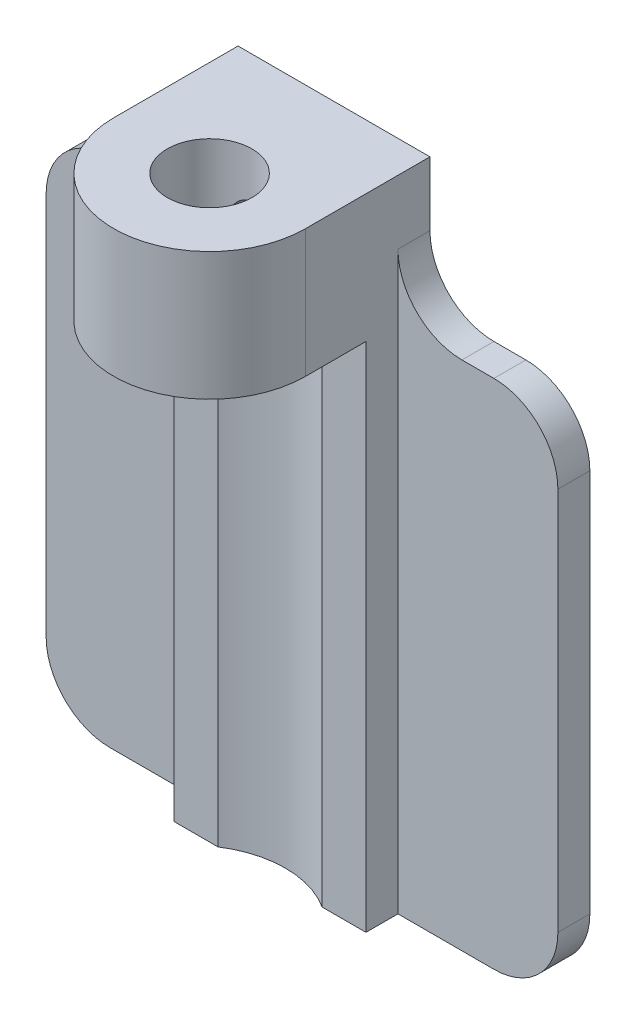
ISO-10303-21;
HEADER;
FILE_DESCRIPTION(('STEP AP214'),'2;1');
FILE_NAME('part.step','',(''),(''),'','','');
FILE_SCHEMA(('AUTOMOTIVE_DESIGN { 1 0 10303 214 1 1 1 1 }'));
ENDSEC;
DATA;
#1=APPLICATION_CONTEXT('core data for automotive mechanical design processes');
#2=APPLICATION_PROTOCOL_DEFINITION('international standard','automotive_design',2000,#1);
#3=PRODUCT_CONTEXT('',#1,'mechanical');
#4=PRODUCT('Part','Part','',(#3));
#5=PRODUCT_RELATED_PRODUCT_CATEGORY('part','',(#4));
#6=PRODUCT_DEFINITION_FORMATION('','',#4);
#7=PRODUCT_DEFINITION_CONTEXT('part definition',#1,'design');
#8=PRODUCT_DEFINITION('design','',#6,#7);
#9=PRODUCT_DEFINITION_SHAPE('','',#8);
#10=(LENGTH_UNIT() NAMED_UNIT(*) SI_UNIT(.MILLI.,.METRE.));
#11=(NAMED_UNIT(*) PLANE_ANGLE_UNIT() SI_UNIT($,.RADIAN.));
#12=(NAMED_UNIT(*) SI_UNIT($,.STERADIAN.) SOLID_ANGLE_UNIT());
#13=UNCERTAINTY_MEASURE_WITH_UNIT(LENGTH_MEASURE(1.E-05),#10,'distance_accuracy_value','');
#14=(GEOMETRIC_REPRESENTATION_CONTEXT(3) GLOBAL_UNCERTAINTY_ASSIGNED_CONTEXT((#13)) GLOBAL_UNIT_ASSIGNED_CONTEXT((#10,
#11,#12)) REPRESENTATION_CONTEXT('',''));
#15=CARTESIAN_POINT('',(0.,0.,0.));
#16=DIRECTION('',(0.,0.,1.));
#17=DIRECTION('',(1.,0.,0.));
#18=AXIS2_PLACEMENT_3D('',#15,#16,#17);
#19=CARTESIAN_POINT('',(4.7625,12.7,4.7625));
#20=DIRECTION('',(0.,1.,0.));
#21=DIRECTION('',(0.,0.,1.));
#22=AXIS2_PLACEMENT_3D('',#19,#20,#21);
#23=PLANE('',#22);
#24=CARTESIAN_POINT('',(0.,12.7,0.));
#25=DIRECTION('',(0.,1.,0.));
#26=DIRECTION('',(0.,0.,1.));
#27=AXIS2_PLACEMENT_3D('',#24,#25,#26);
#28=CIRCLE('',#27,2.1);
#29=CARTESIAN_POINT('',(0.,12.7,2.10000000000001));
#30=VERTEX_POINT('',#29);
#31=EDGE_CURVE('E276',#30,#30,#28,.T.);
#32=ORIENTED_EDGE('',*,*,#31,.T.);
#33=EDGE_LOOP('',(#32));
#34=FACE_BOUND('',#33,.T.);
#35=CARTESIAN_POINT('',(0.,12.7,0.));
#36=DIRECTION('',(0.,1.,0.));
#37=DIRECTION('',(0.,0.,1.));
#38=AXIS2_PLACEMENT_3D('',#35,#36,#37);
#39=CIRCLE('',#38,4.76249999999999);
#40=CARTESIAN_POINT('',(4.7625,12.7,0.));
#41=VERTEX_POINT('',#40);
#42=CARTESIAN_POINT('',(-4.7625,12.7,0.));
#43=VERTEX_POINT('',#42);
#44=EDGE_CURVE('E231',#41,#43,#39,.F.);
#45=ORIENTED_EDGE('',*,*,#44,.T.);
#46=DIRECTION('',(0.,0.,-1.));
#47=VECTOR('',#46,1.);
#48=CARTESIAN_POINT('',(-4.7625,12.7,4.7625));
#49=LINE('',#48,#47);
#50=CARTESIAN_POINT('',(-4.7625,12.7,-3.));
#51=VERTEX_POINT('',#50);
#52=EDGE_CURVE('E279',#43,#51,#49,.T.);
#53=ORIENTED_EDGE('',*,*,#52,.T.);
#54=DIRECTION('',(-1.,0.,0.));
#55=VECTOR('',#54,1.);
#56=CARTESIAN_POINT('',(4.7625,12.7,-3.));
#57=LINE('',#56,#55);
#58=CARTESIAN_POINT('',(-2.58406772357073,12.7,-2.99999999999999));
#59=VERTEX_POINT('',#58);
#60=EDGE_CURVE('E298',#59,#51,#57,.T.);
#61=ORIENTED_EDGE('',*,*,#60,.F.);
#62=CARTESIAN_POINT('',(0.,12.7,1.0005));
#63=DIRECTION('',(0.,1.,0.));
#64=DIRECTION('',(0.,0.,1.));
#65=AXIS2_PLACEMENT_3D('',#62,#63,#64);
#66=CIRCLE('',#65,4.7625);
#67=CARTESIAN_POINT('',(2.58406772357073,12.7,-2.99999999999999));
#68=VERTEX_POINT('',#67);
#69=EDGE_CURVE('E264',#59,#68,#66,.F.);
#70=ORIENTED_EDGE('',*,*,#69,.T.);
#71=CARTESIAN_POINT('',(4.7625,12.7,-3.));
#72=VERTEX_POINT('',#71);
#73=EDGE_CURVE('E299',#72,#68,#57,.T.);
#74=ORIENTED_EDGE('',*,*,#73,.F.);
#75=DIRECTION('',(0.,0.,-1.));
#76=VECTOR('',#75,1.);
#77=CARTESIAN_POINT('',(4.7625,12.7,4.7625));
#78=LINE('',#77,#76);
#79=EDGE_CURVE('E280',#41,#72,#78,.T.);
#80=ORIENTED_EDGE('',*,*,#79,.F.);
#81=EDGE_LOOP('',(#45,#53,#61,#70,#74,#80));
#82=FACE_BOUND('',#81,.T.);
#83=ADVANCED_FACE('F54',(#34,#82),#23,.F.);
#84=CARTESIAN_POINT('',(4.7625,0.,0.));
#85=DIRECTION('',(1.,0.,0.));
#86=DIRECTION('',(0.,0.,-1.));
#87=AXIS2_PLACEMENT_3D('',#84,#85,#86);
#88=PLANE('',#87);
#89=DIRECTION('',(0.,1.,0.));
#90=VECTOR('',#89,1.);
#91=CARTESIAN_POINT('',(4.7625,0.,-4.5875));
#92=LINE('',#91,#90);
#93=CARTESIAN_POINT('',(4.7625,-12.7,-4.5875));
#94=VERTEX_POINT('',#93);
#95=CARTESIAN_POINT('',(4.7625,15.875,-4.5875));
#96=VERTEX_POINT('',#95);
#97=EDGE_CURVE('E69',#94,#96,#92,.T.);
#98=ORIENTED_EDGE('',*,*,#97,.T.);
#99=DIRECTION('',(0.,0.,1.));
#100=VECTOR('',#99,1.);
#101=CARTESIAN_POINT('',(4.7625,15.875,-6.175));
#102=LINE('',#101,#100);
#103=CARTESIAN_POINT('',(4.7625,15.875,-6.175));
#104=VERTEX_POINT('',#103);
#105=EDGE_CURVE('E198',#96,#104,#102,.F.);
#106=ORIENTED_EDGE('',*,*,#105,.T.);
#107=DIRECTION('',(0.,1.,0.));
#108=VECTOR('',#107,1.);
#109=CARTESIAN_POINT('',(4.7625,-12.7,-6.175));
#110=LINE('',#109,#108);
#111=CARTESIAN_POINT('',(4.7625,19.05,-6.175));
#112=VERTEX_POINT('',#111);
#113=EDGE_CURVE('E192',#104,#112,#110,.T.);
#114=ORIENTED_EDGE('',*,*,#113,.T.);
#115=DIRECTION('',(0.,0.,1.));
#116=VECTOR('',#115,1.);
#117=CARTESIAN_POINT('',(4.7625,19.05,-6.175));
#118=LINE('',#117,#116);
#119=CARTESIAN_POINT('',(4.76249999999999,19.05,0.));
#120=VERTEX_POINT('',#119);
#121=EDGE_CURVE('E196',#112,#120,#118,.T.);
#122=ORIENTED_EDGE('',*,*,#121,.T.);
#123=DIRECTION('',(0.,1.,0.));
#124=VECTOR('',#123,1.);
#125=CARTESIAN_POINT('',(4.7625,-12.7,0.));
#126=LINE('',#125,#124);
#127=EDGE_CURVE('E229',#41,#120,#126,.T.);
#128=ORIENTED_EDGE('',*,*,#127,.F.);
#129=ORIENTED_EDGE('',*,*,#79,.T.);
#130=DIRECTION('',(0.,-1.,0.));
#131=VECTOR('',#130,1.);
#132=CARTESIAN_POINT('',(4.7625,12.7,-3.));
#133=LINE('',#132,#131);
#134=CARTESIAN_POINT('',(4.7625,-12.7,-3.));
#135=VERTEX_POINT('',#134);
#136=EDGE_CURVE('E282',#72,#135,#133,.T.);
#137=ORIENTED_EDGE('',*,*,#136,.T.);
#138=DIRECTION('',(0.,0.,-1.));
#139=VECTOR('',#138,1.);
#140=CARTESIAN_POINT('',(4.7625,-12.7,-3.));
#141=LINE('',#140,#139);
#142=EDGE_CURVE('E203',#135,#94,#141,.T.);
#143=ORIENTED_EDGE('',*,*,#142,.T.);
#144=EDGE_LOOP('',(#98,#106,#114,#122,#128,#129,#137,#143));
#145=FACE_BOUND('',#144,.T.);
#146=ADVANCED_FACE('F194',(#145),#88,.T.);
#147=CARTESIAN_POINT('',(4.7625,-12.7,-6.175));
#148=DIRECTION('',(0.,0.,1.));
#149=DIRECTION('',(1.,0.,0.));
#150=AXIS2_PLACEMENT_3D('',#147,#148,#149);
#151=PLANE('',#150);
#152=CARTESIAN_POINT('',(0.,15.875,-6.175));
#153=DIRECTION('',(0.,0.,-1.));
#154=DIRECTION('',(-1.,0.,0.));
#155=AXIS2_PLACEMENT_3D('',#152,#153,#154);
#156=CIRCLE('',#155,0.888999999999999);
#157=CARTESIAN_POINT('',(-0.888999999999999,15.875,-6.175));
#158=VERTEX_POINT('',#157);
#159=EDGE_CURVE('E223',#158,#158,#156,.T.);
#160=ORIENTED_EDGE('',*,*,#159,.F.);
#161=EDGE_LOOP('',(#160));
#162=FACE_BOUND('',#161,.T.);
#163=DIRECTION('',(-1.,0.,0.));
#164=VECTOR('',#163,1.);
#165=CARTESIAN_POINT('',(4.7625,-12.7,-6.175));
#166=LINE('',#165,#164);
#167=CARTESIAN_POINT('',(9.525,-12.7,-6.175));
#168=VERTEX_POINT('',#167);
#169=CARTESIAN_POINT('',(-9.525,-12.7,-6.175));
#170=VERTEX_POINT('',#169);
#171=EDGE_CURVE('E202',#168,#170,#166,.T.);
#172=ORIENTED_EDGE('',*,*,#171,.T.);
#173=CARTESIAN_POINT('',(-9.525,-9.525,-6.175));
#174=DIRECTION('',(0.,0.,1.));
#175=DIRECTION('',(1.,0.,0.));
#176=AXIS2_PLACEMENT_3D('',#173,#174,#175);
#177=CIRCLE('',#176,3.175);
#178=CARTESIAN_POINT('',(-12.7,-9.525,-6.175));
#179=VERTEX_POINT('',#178);
#180=EDGE_CURVE('E317',#170,#179,#177,.F.);
#181=ORIENTED_EDGE('',*,*,#180,.T.);
#182=DIRECTION('',(0.,1.,0.));
#183=VECTOR('',#182,1.);
#184=CARTESIAN_POINT('',(-12.7,12.7,-6.175));
#185=LINE('',#184,#183);
#186=CARTESIAN_POINT('',(-12.7,9.525,-6.175));
#187=VERTEX_POINT('',#186);
#188=EDGE_CURVE('E243',#179,#187,#185,.T.);
#189=ORIENTED_EDGE('',*,*,#188,.T.);
#190=CARTESIAN_POINT('',(-9.525,9.525,-6.175));
#191=DIRECTION('',(0.,0.,1.));
#192=DIRECTION('',(1.,0.,0.));
#193=AXIS2_PLACEMENT_3D('',#190,#191,#192);
#194=CIRCLE('',#193,3.175);
#195=CARTESIAN_POINT('',(-9.525,12.7,-6.175));
#196=VERTEX_POINT('',#195);
#197=EDGE_CURVE('E315',#187,#196,#194,.F.);
#198=ORIENTED_EDGE('',*,*,#197,.T.);
#199=DIRECTION('',(1.,0.,0.));
#200=VECTOR('',#199,1.);
#201=CARTESIAN_POINT('',(-2.58406772357073,12.7,-6.175));
#202=LINE('',#201,#200);
#203=CARTESIAN_POINT('',(-7.9375,12.7,-6.175));
#204=VERTEX_POINT('',#203);
#205=EDGE_CURVE('E252',#196,#204,#202,.T.);
#206=ORIENTED_EDGE('',*,*,#205,.T.);
#207=CARTESIAN_POINT('',(-7.9375,15.875,-6.175));
#208=DIRECTION('',(0.,0.,1.));
#209=DIRECTION('',(1.,0.,0.));
#210=AXIS2_PLACEMENT_3D('',#207,#208,#209);
#211=CIRCLE('',#210,3.175);
#212=CARTESIAN_POINT('',(-4.7625,15.875,-6.175));
#213=VERTEX_POINT('',#212);
#214=EDGE_CURVE('E352',#204,#213,#211,.T.);
#215=ORIENTED_EDGE('',*,*,#214,.T.);
#216=DIRECTION('',(0.,1.,0.));
#217=VECTOR('',#216,1.);
#218=CARTESIAN_POINT('',(-4.7625,-12.7,-6.175));
#219=LINE('',#218,#217);
#220=CARTESIAN_POINT('',(-4.7625,19.05,-6.175));
#221=VERTEX_POINT('',#220);
#222=EDGE_CURVE('E219',#213,#221,#219,.T.);
#223=ORIENTED_EDGE('',*,*,#222,.T.);
#224=DIRECTION('',(1.,0.,0.));
#225=VECTOR('',#224,1.);
#226=CARTESIAN_POINT('',(4.7625,19.05,-6.175));
#227=LINE('',#226,#225);
#228=EDGE_CURVE('E210',#221,#112,#227,.T.);
#229=ORIENTED_EDGE('',*,*,#228,.T.);
#230=ORIENTED_EDGE('',*,*,#113,.F.);
#231=CARTESIAN_POINT('',(7.9375,15.875,-6.175));
#232=DIRECTION('',(0.,0.,1.));
#233=DIRECTION('',(1.,0.,0.));
#234=AXIS2_PLACEMENT_3D('',#231,#232,#233);
#235=CIRCLE('',#234,3.175);
#236=CARTESIAN_POINT('',(7.9375,12.7,-6.175));
#237=VERTEX_POINT('',#236);
#238=EDGE_CURVE('E13',#104,#237,#235,.T.);
#239=ORIENTED_EDGE('',*,*,#238,.T.);
#240=DIRECTION('',(1.,0.,0.));
#241=VECTOR('',#240,1.);
#242=CARTESIAN_POINT('',(12.7,12.7,-6.175));
#243=LINE('',#242,#241);
#244=CARTESIAN_POINT('',(9.52500000000001,12.7,-6.175));
#245=VERTEX_POINT('',#244);
#246=EDGE_CURVE('E239',#237,#245,#243,.T.);
#247=ORIENTED_EDGE('',*,*,#246,.T.);
#248=CARTESIAN_POINT('',(9.52500000000001,9.525,-6.175));
#249=DIRECTION('',(0.,0.,1.));
#250=DIRECTION('',(1.,0.,0.));
#251=AXIS2_PLACEMENT_3D('',#248,#249,#250);
#252=CIRCLE('',#251,3.175);
#253=CARTESIAN_POINT('',(12.7,9.525,-6.175));
#254=VERTEX_POINT('',#253);
#255=EDGE_CURVE('E311',#245,#254,#252,.F.);
#256=ORIENTED_EDGE('',*,*,#255,.T.);
#257=DIRECTION('',(0.,-1.,0.));
#258=VECTOR('',#257,1.);
#259=CARTESIAN_POINT('',(12.7,12.7,-6.175));
#260=LINE('',#259,#258);
#261=CARTESIAN_POINT('',(12.7,-9.525,-6.175));
#262=VERTEX_POINT('',#261);
#263=EDGE_CURVE('E234',#254,#262,#260,.T.);
#264=ORIENTED_EDGE('',*,*,#263,.T.);
#265=CARTESIAN_POINT('',(9.525,-9.525,-6.175));
#266=DIRECTION('',(0.,0.,1.));
#267=DIRECTION('',(1.,0.,0.));
#268=AXIS2_PLACEMENT_3D('',#265,#266,#267);
#269=CIRCLE('',#268,3.175);
#270=EDGE_CURVE('E313',#262,#168,#269,.F.);
#271=ORIENTED_EDGE('',*,*,#270,.T.);
#272=EDGE_LOOP('',(#172,#181,#189,#198,#206,#215,#223,#229,#230,#239,#247,#256,#264,#271));
#273=FACE_BOUND('',#272,.T.);
#274=ADVANCED_FACE('F217',(#162,#273),#151,.F.);
#275=CARTESIAN_POINT('',(4.7625,19.05,-6.175));
#276=DIRECTION('',(0.,-1.,0.));
#277=DIRECTION('',(0.,0.,-1.));
#278=AXIS2_PLACEMENT_3D('',#275,#276,#277);
#279=PLANE('',#278);
#280=CARTESIAN_POINT('',(0.,19.05,0.));
#281=DIRECTION('',(0.,1.,0.));
#282=DIRECTION('',(0.,0.,1.));
#283=AXIS2_PLACEMENT_3D('',#280,#281,#282);
#284=CIRCLE('',#283,2.1);
#285=CARTESIAN_POINT('',(0.,19.05,2.10000000000001));
#286=VERTEX_POINT('',#285);
#287=EDGE_CURVE('E273',#286,#286,#284,.T.);
#288=ORIENTED_EDGE('',*,*,#287,.F.);
#289=EDGE_LOOP('',(#288));
#290=FACE_BOUND('',#289,.T.);
#291=CARTESIAN_POINT('',(0.,19.05,0.));
#292=DIRECTION('',(0.,1.,0.));
#293=DIRECTION('',(0.,0.,1.));
#294=AXIS2_PLACEMENT_3D('',#291,#292,#293);
#295=CIRCLE('',#294,4.76249999999999);
#296=CARTESIAN_POINT('',(-4.76249999999999,19.05,0.));
#297=VERTEX_POINT('',#296);
#298=EDGE_CURVE('E213',#297,#120,#295,.T.);
#299=ORIENTED_EDGE('',*,*,#298,.T.);
#300=ORIENTED_EDGE('',*,*,#121,.F.);
#301=ORIENTED_EDGE('',*,*,#228,.F.);
#302=DIRECTION('',(0.,0.,-1.));
#303=VECTOR('',#302,1.);
#304=CARTESIAN_POINT('',(-4.7625,19.05,-6.175));
#305=LINE('',#304,#303);
#306=EDGE_CURVE('E214',#297,#221,#305,.T.);
#307=ORIENTED_EDGE('',*,*,#306,.F.);
#308=EDGE_LOOP('',(#299,#300,#301,#307));
#309=FACE_BOUND('',#308,.T.);
#310=ADVANCED_FACE('F208',(#290,#309),#279,.F.);
#311=CARTESIAN_POINT('',(-4.7625,0.,0.));
#312=DIRECTION('',(1.,0.,0.));
#313=DIRECTION('',(0.,0.,-1.));
#314=AXIS2_PLACEMENT_3D('',#311,#312,#313);
#315=PLANE('',#314);
#316=ORIENTED_EDGE('',*,*,#222,.F.);
#317=DIRECTION('',(0.,0.,1.));
#318=VECTOR('',#317,1.);
#319=CARTESIAN_POINT('',(-4.7625,15.875,0.));
#320=LINE('',#319,#318);
#321=CARTESIAN_POINT('',(-4.7625,15.875,-4.5875));
#322=VERTEX_POINT('',#321);
#323=EDGE_CURVE('E332',#213,#322,#320,.T.);
#324=ORIENTED_EDGE('',*,*,#323,.T.);
#325=DIRECTION('',(0.,-1.,0.));
#326=VECTOR('',#325,1.);
#327=CARTESIAN_POINT('',(-4.7625,0.,-4.5875));
#328=LINE('',#327,#326);
#329=CARTESIAN_POINT('',(-4.7625,-12.7,-4.5875));
#330=VERTEX_POINT('',#329);
#331=EDGE_CURVE('E302',#322,#330,#328,.T.);
#332=ORIENTED_EDGE('',*,*,#331,.T.);
#333=DIRECTION('',(0.,0.,-1.));
#334=VECTOR('',#333,1.);
#335=CARTESIAN_POINT('',(-4.7625,-12.7,-3.));
#336=LINE('',#335,#334);
#337=CARTESIAN_POINT('',(-4.7625,-12.7,-3.));
#338=VERTEX_POINT('',#337);
#339=EDGE_CURVE('E289',#338,#330,#336,.T.);
#340=ORIENTED_EDGE('',*,*,#339,.F.);
#341=DIRECTION('',(0.,-1.,0.));
#342=VECTOR('',#341,1.);
#343=CARTESIAN_POINT('',(-4.7625,12.7,-3.));
#344=LINE('',#343,#342);
#345=EDGE_CURVE('E286',#51,#338,#344,.T.);
#346=ORIENTED_EDGE('',*,*,#345,.F.);
#347=ORIENTED_EDGE('',*,*,#52,.F.);
#348=DIRECTION('',(0.,1.,0.));
#349=VECTOR('',#348,1.);
#350=CARTESIAN_POINT('',(-4.7625,-12.7,0.));
#351=LINE('',#350,#349);
#352=EDGE_CURVE('E227',#43,#297,#351,.T.);
#353=ORIENTED_EDGE('',*,*,#352,.T.);
#354=ORIENTED_EDGE('',*,*,#306,.T.);
#355=EDGE_LOOP('',(#316,#324,#332,#340,#346,#347,#353,#354));
#356=FACE_BOUND('',#355,.T.);
#357=ADVANCED_FACE('F400',(#356),#315,.F.);
#358=CARTESIAN_POINT('',(4.7625,12.7,-3.));
#359=DIRECTION('',(0.,0.,-1.));
#360=DIRECTION('',(0.,1.,0.));
#361=AXIS2_PLACEMENT_3D('',#358,#359,#360);
#362=PLANE('',#361);
#363=ORIENTED_EDGE('',*,*,#73,.T.);
#364=DIRECTION('',(0.,-1.,0.));
#365=VECTOR('',#364,1.);
#366=CARTESIAN_POINT('',(2.58406772357073,26.1703841816037,-2.99999999999999));
#367=LINE('',#366,#365);
#368=CARTESIAN_POINT('',(2.58406772357072,-12.7,-3.));
#369=VERTEX_POINT('',#368);
#370=EDGE_CURVE('E270',#68,#369,#367,.T.);
#371=ORIENTED_EDGE('',*,*,#370,.T.);
#372=DIRECTION('',(-1.,0.,0.));
#373=VECTOR('',#372,1.);
#374=CARTESIAN_POINT('',(4.7625,-12.7,-3.));
#375=LINE('',#374,#373);
#376=EDGE_CURVE('E295',#135,#369,#375,.T.);
#377=ORIENTED_EDGE('',*,*,#376,.F.);
#378=ORIENTED_EDGE('',*,*,#136,.F.);
#379=EDGE_LOOP('',(#363,#371,#377,#378));
#380=FACE_BOUND('',#379,.T.);
#381=ADVANCED_FACE('F413',(#380),#362,.F.);
#382=CARTESIAN_POINT('',(-2.58406772357072,-12.7,-3.));
#383=VERTEX_POINT('',#382);
#384=EDGE_CURVE('E294',#383,#338,#375,.T.);
#385=ORIENTED_EDGE('',*,*,#384,.F.);
#386=DIRECTION('',(0.,-1.,0.));
#387=VECTOR('',#386,1.);
#388=CARTESIAN_POINT('',(-2.58406772357073,26.1703841816037,-2.99999999999999));
#389=LINE('',#388,#387);
#390=EDGE_CURVE('E267',#383,#59,#389,.F.);
#391=ORIENTED_EDGE('',*,*,#390,.T.);
#392=ORIENTED_EDGE('',*,*,#60,.T.);
#393=ORIENTED_EDGE('',*,*,#345,.T.);
#394=EDGE_LOOP('',(#385,#391,#392,#393));
#395=FACE_BOUND('',#394,.T.);
#396=ADVANCED_FACE('F419',(#395),#362,.F.);
#397=CARTESIAN_POINT('',(4.7625,-12.7,-3.));
#398=DIRECTION('',(0.,1.,0.));
#399=DIRECTION('',(0.,0.,1.));
#400=AXIS2_PLACEMENT_3D('',#397,#398,#399);
#401=PLANE('',#400);
#402=DIRECTION('',(-1.,0.,0.));
#403=VECTOR('',#402,1.);
#404=CARTESIAN_POINT('',(-2.58406772357072,-12.7,-4.5875));
#405=LINE('',#404,#403);
#406=CARTESIAN_POINT('',(-9.525,-12.7,-4.5875));
#407=VERTEX_POINT('',#406);
#408=EDGE_CURVE('E248',#330,#407,#405,.T.);
#409=ORIENTED_EDGE('',*,*,#408,.T.);
#410=DIRECTION('',(0.,0.,-1.));
#411=VECTOR('',#410,1.);
#412=CARTESIAN_POINT('',(-9.525,-12.7,-6.175));
#413=LINE('',#412,#411);
#414=EDGE_CURVE('E308',#407,#170,#413,.T.);
#415=ORIENTED_EDGE('',*,*,#414,.T.);
#416=ORIENTED_EDGE('',*,*,#171,.F.);
#417=DIRECTION('',(0.,0.,-1.));
#418=VECTOR('',#417,1.);
#419=CARTESIAN_POINT('',(9.525,-12.7,-4.5875));
#420=LINE('',#419,#418);
#421=CARTESIAN_POINT('',(9.525,-12.7,-4.5875));
#422=VERTEX_POINT('',#421);
#423=EDGE_CURVE('E306',#168,#422,#420,.F.);
#424=ORIENTED_EDGE('',*,*,#423,.T.);
#425=DIRECTION('',(-1.,0.,0.));
#426=VECTOR('',#425,1.);
#427=CARTESIAN_POINT('',(12.7,-12.7,-4.5875));
#428=LINE('',#427,#426);
#429=EDGE_CURVE('E238',#422,#94,#428,.T.);
#430=ORIENTED_EDGE('',*,*,#429,.T.);
#431=ORIENTED_EDGE('',*,*,#142,.F.);
#432=ORIENTED_EDGE('',*,*,#376,.T.);
#433=CARTESIAN_POINT('',(0.,-12.7,1.0005));
#434=DIRECTION('',(0.,-1.,0.));
#435=DIRECTION('',(0.,0.,-1.));
#436=AXIS2_PLACEMENT_3D('',#433,#434,#435);
#437=CIRCLE('',#436,4.7625);
#438=EDGE_CURVE('E258',#383,#369,#437,.T.);
#439=ORIENTED_EDGE('',*,*,#438,.F.);
#440=ORIENTED_EDGE('',*,*,#384,.T.);
#441=ORIENTED_EDGE('',*,*,#339,.T.);
#442=EDGE_LOOP('',(#409,#415,#416,#424,#430,#431,#432,#439,#440,#441));
#443=FACE_BOUND('',#442,.T.);
#444=ADVANCED_FACE('F374',(#443),#401,.F.);
#445=CARTESIAN_POINT('',(0.,-12.7,0.));
#446=DIRECTION('',(0.,1.,0.));
#447=DIRECTION('',(0.,0.,1.));
#448=AXIS2_PLACEMENT_3D('',#445,#446,#447);
#449=CYLINDRICAL_SURFACE('',#448,2.1);
#450=CARTESIAN_POINT('',(-0.888999999999999,15.875,-1.90254540024673));
#451=CARTESIAN_POINT('',(-0.888994469992247,15.9223387829292,-1.90255081771831));
#452=CARTESIAN_POINT('',(-0.885194888822248,15.9697516214338,-1.90433805997773));
#453=CARTESIAN_POINT('',(-0.870145538369989,16.0632042741445,-1.91125887343001));
#454=CARTESIAN_POINT('',(-0.858875841013887,16.1092400705471,-1.91640139494466));
#455=CARTESIAN_POINT('',(-0.829408471882538,16.1984158479335,-1.92933599860138));
#456=CARTESIAN_POINT('',(-0.811239660875879,16.2415670234707,-1.93711702886772));
#457=CARTESIAN_POINT('',(-0.768574688905736,16.3241968022605,-1.95443621170155));
#458=CARTESIAN_POINT('',(-0.744079882690027,16.3636761893882,-1.96397398792665));
#459=CARTESIAN_POINT('',(-0.687775231463081,16.4404026243554,-1.98441728014083));
#460=CARTESIAN_POINT('',(-0.655622156538615,16.4773853126596,-1.99537011855512));
#461=CARTESIAN_POINT('',(-0.58563391347724,16.5456297577181,-2.01702110963046));
#462=CARTESIAN_POINT('',(-0.547796523550273,16.5768892668446,-2.02771916080186));
#463=CARTESIAN_POINT('',(-0.465422400996654,16.634163825128,-2.04823356746498));
#464=CARTESIAN_POINT('',(-0.420660727817364,16.6598793507567,-2.05798853220256));
#465=CARTESIAN_POINT('',(-0.326958892160891,16.7033003995448,-2.07493596612263));
#466=CARTESIAN_POINT('',(-0.278020653527843,16.7210095872286,-2.0821296073095));
#467=CARTESIAN_POINT('',(-0.180132432684004,16.7469506872909,-2.09280788708359));
#468=CARTESIAN_POINT('',(-0.131323212752707,16.7556390332087,-2.09647040120334));
#469=CARTESIAN_POINT('',(-0.0328115432963445,16.7647687683728,-2.10032120489775));
#470=CARTESIAN_POINT('',(0.0168905227660031,16.7652136171302,-2.10051095187237));
#471=CARTESIAN_POINT('',(0.112450187580507,16.7580783327802,-2.09749810718364));
#472=CARTESIAN_POINT('',(0.158353238587653,16.7510002921122,-2.09450775448221));
#473=CARTESIAN_POINT('',(0.248248470052418,16.7298836007679,-2.08576437192967));
#474=CARTESIAN_POINT('',(0.292240509171504,16.7158444361965,-2.0800111381138));
#475=CARTESIAN_POINT('',(0.377875769680845,16.6810401060928,-2.0661852709573));
#476=CARTESIAN_POINT('',(0.419472786579214,16.66017537118,-2.05807851528194));
#477=CARTESIAN_POINT('',(0.498684434345348,16.6124116768972,-2.04033426523702));
#478=CARTESIAN_POINT('',(0.536297636921785,16.5855105640508,-2.03069622494119));
#479=CARTESIAN_POINT('',(0.609369781038828,16.5241736818729,-2.01002812378684));
#480=CARTESIAN_POINT('',(0.644475357456707,16.4893332990353,-1.99894780105441));
#481=CARTESIAN_POINT('',(0.70850130309534,16.4142429476606,-1.97716262988925));
#482=CARTESIAN_POINT('',(0.737419129485909,16.3739907661892,-1.9664579373251));
#483=CARTESIAN_POINT('',(0.789197637841959,16.2874521099347,-1.94627030518905));
#484=CARTESIAN_POINT('',(0.811812104984177,16.2410042264141,-1.93684294528382));
#485=CARTESIAN_POINT('',(0.848752850637234,16.1444546902905,-1.92094450721929));
#486=CARTESIAN_POINT('',(0.863085277681858,16.0943557793846,-1.9144712367155));
#487=CARTESIAN_POINT('',(0.882140611006368,15.9954714135412,-1.90576265278554));
#488=CARTESIAN_POINT('',(0.887437965718916,15.9468193296247,-1.90327466906937));
#489=CARTESIAN_POINT('',(0.88996461595258,15.8492682411763,-1.90209522907359));
#490=CARTESIAN_POINT('',(0.887196856102171,15.8003693332693,-1.90340238716114));
#491=CARTESIAN_POINT('',(0.874196504553568,15.707168976564,-1.90940421905677));
#492=CARTESIAN_POINT('',(0.864476674277658,15.662779053439,-1.91386597362976));
#493=CARTESIAN_POINT('',(0.838533455980389,15.5762997229208,-1.92537307828886));
#494=CARTESIAN_POINT('',(0.82230851488828,15.5342108676278,-1.93241904531173));
#495=CARTESIAN_POINT('',(0.783043740386818,15.45150390247,-1.94866904476284));
#496=CARTESIAN_POINT('',(0.759740870268919,15.4110268534345,-1.95795284493796));
#497=CARTESIAN_POINT('',(0.707240573173514,15.3343590683249,-1.97752240512083));
#498=CARTESIAN_POINT('',(0.678040537767707,15.2981702402912,-1.98780860746461));
#499=CARTESIAN_POINT('',(0.611666464749097,15.2279200207947,-2.00927326420447));
#500=CARTESIAN_POINT('',(0.574026957355294,15.1942972351298,-2.02045362264818));
#501=CARTESIAN_POINT('',(0.493384931567988,15.1337618872899,-2.04164335540925));
#502=CARTESIAN_POINT('',(0.450381942146268,15.106849915091,-2.05165262673035));
#503=CARTESIAN_POINT('',(0.359860977903617,15.060497111099,-2.06945237315592));
#504=CARTESIAN_POINT('',(0.312326300843975,15.041085363116,-2.07723418114867));
#505=CARTESIAN_POINT('',(0.214250743925476,15.0106800769149,-2.08962514263605));
#506=CARTESIAN_POINT('',(0.163711738150265,14.9996813488725,-2.0942362518938));
#507=CARTESIAN_POINT('',(0.0649757832705631,14.9870831194714,-2.09953474776778));
#508=CARTESIAN_POINT('',(0.0168709874646379,14.9848658172214,-2.10047993509863));
#509=CARTESIAN_POINT('',(-0.0790109952148733,14.9882203920003,-2.09906035164976));
#510=CARTESIAN_POINT('',(-0.126788241199416,14.9937908243436,-2.09669619477916));
#511=CARTESIAN_POINT('',(-0.218808613250501,15.0121191890824,-2.08906128273812));
#512=CARTESIAN_POINT('',(-0.26311708223887,15.0245997842874,-2.08390283845572));
#513=CARTESIAN_POINT('',(-0.348990705391444,15.0560865673003,-2.071253483166));
#514=CARTESIAN_POINT('',(-0.390555345585088,15.0750939735902,-2.06376213665649));
#515=CARTESIAN_POINT('',(-0.471845495723289,15.1200577712165,-2.04674492277115));
#516=CARTESIAN_POINT('',(-0.511401482847712,15.1462907992052,-2.03714204344643));
#517=CARTESIAN_POINT('',(-0.58572039919195,15.204563898364,-2.01703155644679));
#518=CARTESIAN_POINT('',(-0.620481472634225,15.2366062068605,-2.0065236010215));
#519=CARTESIAN_POINT('',(-0.686779235343601,15.3082529459916,-1.9848514967477));
#520=CARTESIAN_POINT('',(-0.717914950401656,15.3482315785585,-1.97369340329946));
#521=CARTESIAN_POINT('',(-0.773100964840062,15.4331841248779,-1.95273901727451));
#522=CARTESIAN_POINT('',(-0.797147218790737,15.4781608706068,-1.94294350389844));
#523=CARTESIAN_POINT('',(-0.837256664017792,15.5718334342998,-1.92600001295001));
#524=CARTESIAN_POINT('',(-0.853347150146969,15.6205158657683,-1.91884300493477));
#525=CARTESIAN_POINT('',(-0.876906723572653,15.7202096160894,-1.9081952077678));
#526=CARTESIAN_POINT('',(-0.884404728267432,15.7712125193442,-1.9046921251806));
#527=CARTESIAN_POINT('',(-0.888483580502621,15.8399420332996,-1.90278584036577));
#528=CARTESIAN_POINT('',(-0.889002048288948,15.8574659367081,-1.90254339364065));
#529=CARTESIAN_POINT('',(-0.888999999999999,15.875,-1.90254540024673));
#530=B_SPLINE_CURVE_WITH_KNOTS('',3,(#450,#451,#452,#453,#454,#455,#456,#457,#458,#459,#460,
#461,#462,#463,#464,#465,#466,#467,#468,#469,#470,#471,#472,#473,#474,#475,#476,#477,#478,#479,
#480,#481,#482,#483,#484,#485,#486,#487,#488,#489,#490,#491,#492,#493,#494,#495,#496,#497,#498,
#499,#500,#501,#502,#503,#504,#505,#506,#507,#508,#509,#510,#511,#512,#513,#514,#515,#516,#517,
#518,#519,#520,#521,#522,#523,#524,#525,#526,#527,#528,#529),.UNSPECIFIED.,.T.,.F.,(4,2,2,2,2,2,
2,2,2,2,2,2,2,2,2,2,2,2,2,2,2,2,2,2,2,2,2,2,2,2,2,2,2,2,2,2,2,2,2,4),(0.,0.141964828868661,
0.284309910618477,0.42606597168572,0.567791700025372,0.717780620104784,0.867828318614159,
1.02463230308601,1.18136444507265,1.32970961013082,1.47799251843813,1.6169655303572,
1.75594880328783,1.89705737235574,2.03821636213155,2.18959966815323,2.34104506554554,
2.49776837235552,2.6543751788038,2.80059208477864,2.94675561265099,3.08312258005837,
3.21952212397202,3.36178675401933,3.50411444878082,3.65847643111872,3.8128519792918,
3.96782028528908,4.12269291715906,4.26645287300532,4.41018616379413,4.54852997556364,
4.68689962861586,4.83156000919427,4.97627622158705,5.13121066161972,5.2862333408889,
5.44072040863071,5.594686019766,5.64726912690524),.UNSPECIFIED.);
#531=CARTESIAN_POINT('',(-0.888999999999999,15.875,-1.90254540024673));
#532=VERTEX_POINT('',#531);
#533=EDGE_CURVE('E220',#532,#532,#530,.T.);
#534=ORIENTED_EDGE('',*,*,#533,.T.);
#535=EDGE_LOOP('',(#534));
#536=FACE_BOUND('',#535,.T.);
#537=ORIENTED_EDGE('',*,*,#287,.T.);
#538=EDGE_LOOP('',(#537));
#539=FACE_BOUND('',#538,.T.);
#540=ORIENTED_EDGE('',*,*,#31,.F.);
#541=EDGE_LOOP('',(#540));
#542=FACE_BOUND('',#541,.T.);
#543=ADVANCED_FACE('F485',(#536,#539,#542),#449,.F.);
#544=CARTESIAN_POINT('',(0.,26.1703841816037,1.0005));
#545=DIRECTION('',(0.,-1.,0.));
#546=DIRECTION('',(0.,0.,-1.));
#547=AXIS2_PLACEMENT_3D('',#544,#545,#546);
#548=CYLINDRICAL_SURFACE('',#547,4.7625);
#549=ORIENTED_EDGE('',*,*,#69,.F.);
#550=ORIENTED_EDGE('',*,*,#390,.F.);
#551=ORIENTED_EDGE('',*,*,#438,.T.);
#552=ORIENTED_EDGE('',*,*,#370,.F.);
#553=EDGE_LOOP('',(#549,#550,#551,#552));
#554=FACE_BOUND('',#553,.T.);
#555=ADVANCED_FACE('F431',(#554),#548,.F.);
#556=CARTESIAN_POINT('',(-2.58406772357073,12.7,-4.5875));
#557=DIRECTION('',(0.,1.,0.));
#558=DIRECTION('',(0.,0.,1.));
#559=AXIS2_PLACEMENT_3D('',#556,#557,#558);
#560=PLANE('',#559);
#561=ORIENTED_EDGE('',*,*,#205,.F.);
#562=DIRECTION('',(0.,0.,-1.));
#563=VECTOR('',#562,1.);
#564=CARTESIAN_POINT('',(-9.525,12.7,-4.5875));
#565=LINE('',#564,#563);
#566=CARTESIAN_POINT('',(-9.525,12.7,-4.5875));
#567=VERTEX_POINT('',#566);
#568=EDGE_CURVE('E330',#196,#567,#565,.F.);
#569=ORIENTED_EDGE('',*,*,#568,.T.);
#570=DIRECTION('',(1.,0.,0.));
#571=VECTOR('',#570,1.);
#572=CARTESIAN_POINT('',(-2.58406772357073,12.7,-4.5875));
#573=LINE('',#572,#571);
#574=CARTESIAN_POINT('',(-7.9375,12.7,-4.5875));
#575=VERTEX_POINT('',#574);
#576=EDGE_CURVE('E255',#567,#575,#573,.T.);
#577=ORIENTED_EDGE('',*,*,#576,.T.);
#578=DIRECTION('',(0.,0.,1.));
#579=VECTOR('',#578,1.);
#580=CARTESIAN_POINT('',(-7.9375,12.7,-4.5875));
#581=LINE('',#580,#579);
#582=EDGE_CURVE('E328',#575,#204,#581,.F.);
#583=ORIENTED_EDGE('',*,*,#582,.T.);
#584=EDGE_LOOP('',(#561,#569,#577,#583));
#585=FACE_BOUND('',#584,.T.);
#586=ADVANCED_FACE('F392',(#585),#560,.T.);
#587=CARTESIAN_POINT('',(0.,0.,-4.5875));
#588=DIRECTION('',(0.,0.,1.));
#589=DIRECTION('',(1.,0.,0.));
#590=AXIS2_PLACEMENT_3D('',#587,#588,#589);
#591=PLANE('',#590);
#592=DIRECTION('',(0.,1.,0.));
#593=VECTOR('',#592,1.);
#594=CARTESIAN_POINT('',(-12.7,12.7,-4.5875));
#595=LINE('',#594,#593);
#596=CARTESIAN_POINT('',(-12.7,-9.525,-4.5875));
#597=VERTEX_POINT('',#596);
#598=CARTESIAN_POINT('',(-12.7,9.525,-4.5875));
#599=VERTEX_POINT('',#598);
#600=EDGE_CURVE('E251',#597,#599,#595,.T.);
#601=ORIENTED_EDGE('',*,*,#600,.F.);
#602=CARTESIAN_POINT('',(-9.525,-9.525,-4.5875));
#603=DIRECTION('',(0.,0.,1.));
#604=DIRECTION('',(1.,0.,0.));
#605=AXIS2_PLACEMENT_3D('',#602,#603,#604);
#606=CIRCLE('',#605,3.175);
#607=EDGE_CURVE('E326',#597,#407,#606,.T.);
#608=ORIENTED_EDGE('',*,*,#607,.T.);
#609=ORIENTED_EDGE('',*,*,#408,.F.);
#610=ORIENTED_EDGE('',*,*,#331,.F.);
#611=CARTESIAN_POINT('',(-7.9375,15.875,-4.5875));
#612=DIRECTION('',(0.,0.,1.));
#613=DIRECTION('',(1.,0.,0.));
#614=AXIS2_PLACEMENT_3D('',#611,#612,#613);
#615=CIRCLE('',#614,3.175);
#616=EDGE_CURVE('E350',#322,#575,#615,.F.);
#617=ORIENTED_EDGE('',*,*,#616,.T.);
#618=ORIENTED_EDGE('',*,*,#576,.F.);
#619=CARTESIAN_POINT('',(-9.525,9.525,-4.5875));
#620=DIRECTION('',(0.,0.,1.));
#621=DIRECTION('',(1.,0.,0.));
#622=AXIS2_PLACEMENT_3D('',#619,#620,#621);
#623=CIRCLE('',#622,3.175);
#624=EDGE_CURVE('E324',#567,#599,#623,.T.);
#625=ORIENTED_EDGE('',*,*,#624,.T.);
#626=EDGE_LOOP('',(#601,#608,#609,#610,#617,#618,#625));
#627=FACE_BOUND('',#626,.T.);
#628=ADVANCED_FACE('F423',(#627),#591,.T.);
#629=CARTESIAN_POINT('',(-12.7,12.7,-4.5875));
#630=DIRECTION('',(-1.,0.,0.));
#631=DIRECTION('',(0.,-1.,0.));
#632=AXIS2_PLACEMENT_3D('',#629,#630,#631);
#633=PLANE('',#632);
#634=ORIENTED_EDGE('',*,*,#188,.F.);
#635=DIRECTION('',(0.,0.,-1.));
#636=VECTOR('',#635,1.);
#637=CARTESIAN_POINT('',(-12.7,-9.525,-4.5875));
#638=LINE('',#637,#636);
#639=EDGE_CURVE('E322',#179,#597,#638,.F.);
#640=ORIENTED_EDGE('',*,*,#639,.T.);
#641=ORIENTED_EDGE('',*,*,#600,.T.);
#642=DIRECTION('',(0.,0.,-1.));
#643=VECTOR('',#642,1.);
#644=CARTESIAN_POINT('',(-12.7,9.525,-4.5875));
#645=LINE('',#644,#643);
#646=EDGE_CURVE('E319',#599,#187,#645,.T.);
#647=ORIENTED_EDGE('',*,*,#646,.T.);
#648=EDGE_LOOP('',(#634,#640,#641,#647));
#649=FACE_BOUND('',#648,.T.);
#650=ADVANCED_FACE('F382',(#649),#633,.T.);
#651=CARTESIAN_POINT('',(12.7,12.7,-4.5875));
#652=DIRECTION('',(1.,0.,0.));
#653=DIRECTION('',(0.,1.,0.));
#654=AXIS2_PLACEMENT_3D('',#651,#652,#653);
#655=PLANE('',#654);
#656=DIRECTION('',(0.,-1.,0.));
#657=VECTOR('',#656,1.);
#658=CARTESIAN_POINT('',(12.7,12.7,-4.5875));
#659=LINE('',#658,#657);
#660=CARTESIAN_POINT('',(12.7,9.525,-4.5875));
#661=VERTEX_POINT('',#660);
#662=CARTESIAN_POINT('',(12.7,-9.525,-4.5875));
#663=VERTEX_POINT('',#662);
#664=EDGE_CURVE('E235',#661,#663,#659,.T.);
#665=ORIENTED_EDGE('',*,*,#664,.T.);
#666=DIRECTION('',(0.,0.,-1.));
#667=VECTOR('',#666,1.);
#668=CARTESIAN_POINT('',(12.7,-9.525,-6.175));
#669=LINE('',#668,#667);
#670=EDGE_CURVE('E337',#663,#262,#669,.T.);
#671=ORIENTED_EDGE('',*,*,#670,.T.);
#672=ORIENTED_EDGE('',*,*,#263,.F.);
#673=DIRECTION('',(0.,0.,-1.));
#674=VECTOR('',#673,1.);
#675=CARTESIAN_POINT('',(12.7,9.525,-4.5875));
#676=LINE('',#675,#674);
#677=EDGE_CURVE('E335',#254,#661,#676,.F.);
#678=ORIENTED_EDGE('',*,*,#677,.T.);
#679=EDGE_LOOP('',(#665,#671,#672,#678));
#680=FACE_BOUND('',#679,.T.);
#681=ADVANCED_FACE('F366',(#680),#655,.T.);
#682=CARTESIAN_POINT('',(12.7,12.7,-4.5875));
#683=DIRECTION('',(0.,1.,0.));
#684=DIRECTION('',(0.,0.,1.));
#685=AXIS2_PLACEMENT_3D('',#682,#683,#684);
#686=PLANE('',#685);
#687=DIRECTION('',(1.,0.,0.));
#688=VECTOR('',#687,1.);
#689=CARTESIAN_POINT('',(12.7,12.7,-4.5875));
#690=LINE('',#689,#688);
#691=CARTESIAN_POINT('',(7.9375,12.7,-4.5875));
#692=VERTEX_POINT('',#691);
#693=CARTESIAN_POINT('',(9.52500000000001,12.7,-4.5875));
#694=VERTEX_POINT('',#693);
#695=EDGE_CURVE('E241',#692,#694,#690,.T.);
#696=ORIENTED_EDGE('',*,*,#695,.T.);
#697=DIRECTION('',(0.,0.,-1.));
#698=VECTOR('',#697,1.);
#699=CARTESIAN_POINT('',(9.52500000000001,12.7,-4.5875));
#700=LINE('',#699,#698);
#701=EDGE_CURVE('E346',#694,#245,#700,.T.);
#702=ORIENTED_EDGE('',*,*,#701,.T.);
#703=ORIENTED_EDGE('',*,*,#246,.F.);
#704=DIRECTION('',(0.,0.,1.));
#705=VECTOR('',#704,1.);
#706=CARTESIAN_POINT('',(7.9375,12.7,-4.5875));
#707=LINE('',#706,#705);
#708=EDGE_CURVE('E343',#237,#692,#707,.T.);
#709=ORIENTED_EDGE('',*,*,#708,.T.);
#710=EDGE_LOOP('',(#696,#702,#703,#709));
#711=FACE_BOUND('',#710,.T.);
#712=ADVANCED_FACE('F359',(#711),#686,.T.);
#713=CARTESIAN_POINT('',(0.,0.,-4.5875));
#714=DIRECTION('',(0.,0.,-1.));
#715=DIRECTION('',(-1.,0.,0.));
#716=AXIS2_PLACEMENT_3D('',#713,#714,#715);
#717=PLANE('',#716);
#718=ORIENTED_EDGE('',*,*,#429,.F.);
#719=CARTESIAN_POINT('',(9.525,-9.525,-4.5875));
#720=DIRECTION('',(0.,0.,-1.));
#721=DIRECTION('',(-1.,0.,0.));
#722=AXIS2_PLACEMENT_3D('',#719,#720,#721);
#723=CIRCLE('',#722,3.175);
#724=EDGE_CURVE('E341',#422,#663,#723,.F.);
#725=ORIENTED_EDGE('',*,*,#724,.T.);
#726=ORIENTED_EDGE('',*,*,#664,.F.);
#727=CARTESIAN_POINT('',(9.52500000000001,9.525,-4.5875));
#728=DIRECTION('',(0.,0.,-1.));
#729=DIRECTION('',(-1.,0.,0.));
#730=AXIS2_PLACEMENT_3D('',#727,#728,#729);
#731=CIRCLE('',#730,3.175);
#732=EDGE_CURVE('E77',#661,#694,#731,.F.);
#733=ORIENTED_EDGE('',*,*,#732,.T.);
#734=ORIENTED_EDGE('',*,*,#695,.F.);
#735=CARTESIAN_POINT('',(7.9375,15.875,-4.5875));
#736=DIRECTION('',(0.,0.,-1.));
#737=DIRECTION('',(-1.,0.,0.));
#738=AXIS2_PLACEMENT_3D('',#735,#736,#737);
#739=CIRCLE('',#738,3.175);
#740=EDGE_CURVE('E62',#692,#96,#739,.T.);
#741=ORIENTED_EDGE('',*,*,#740,.T.);
#742=ORIENTED_EDGE('',*,*,#97,.F.);
#743=EDGE_LOOP('',(#718,#725,#726,#733,#734,#741,#742));
#744=FACE_BOUND('',#743,.T.);
#745=ADVANCED_FACE('F354',(#744),#717,.F.);
#746=CARTESIAN_POINT('',(0.,15.875,0.));
#747=DIRECTION('',(0.,1.,0.));
#748=DIRECTION('',(0.,0.,1.));
#749=AXIS2_PLACEMENT_3D('',#746,#747,#748);
#750=CYLINDRICAL_SURFACE('',#749,4.76249999999999);
#751=ORIENTED_EDGE('',*,*,#127,.T.);
#752=ORIENTED_EDGE('',*,*,#298,.F.);
#753=ORIENTED_EDGE('',*,*,#352,.F.);
#754=ORIENTED_EDGE('',*,*,#44,.F.);
#755=EDGE_LOOP('',(#751,#752,#753,#754));
#756=FACE_BOUND('',#755,.T.);
#757=ADVANCED_FACE('F405',(#756),#750,.T.);
#758=CARTESIAN_POINT('',(-9.525,-9.525,-3.));
#759=DIRECTION('',(0.,0.,1.));
#760=DIRECTION('',(1.,0.,0.));
#761=AXIS2_PLACEMENT_3D('',#758,#759,#760);
#762=CYLINDRICAL_SURFACE('',#761,3.175);
#763=ORIENTED_EDGE('',*,*,#607,.F.);
#764=ORIENTED_EDGE('',*,*,#639,.F.);
#765=ORIENTED_EDGE('',*,*,#180,.F.);
#766=ORIENTED_EDGE('',*,*,#414,.F.);
#767=EDGE_LOOP('',(#763,#764,#765,#766));
#768=FACE_BOUND('',#767,.T.);
#769=ADVANCED_FACE('F378',(#768),#762,.T.);
#770=CARTESIAN_POINT('',(-9.525,9.525,-4.5875));
#771=DIRECTION('',(0.,0.,-1.));
#772=DIRECTION('',(-1.,0.,0.));
#773=AXIS2_PLACEMENT_3D('',#770,#771,#772);
#774=CYLINDRICAL_SURFACE('',#773,3.175);
#775=ORIENTED_EDGE('',*,*,#624,.F.);
#776=ORIENTED_EDGE('',*,*,#568,.F.);
#777=ORIENTED_EDGE('',*,*,#197,.F.);
#778=ORIENTED_EDGE('',*,*,#646,.F.);
#779=EDGE_LOOP('',(#775,#776,#777,#778));
#780=FACE_BOUND('',#779,.T.);
#781=ADVANCED_FACE('F387',(#780),#774,.T.);
#782=CARTESIAN_POINT('',(-7.9375,15.875,0.));
#783=DIRECTION('',(0.,0.,1.));
#784=DIRECTION('',(1.,0.,0.));
#785=AXIS2_PLACEMENT_3D('',#782,#783,#784);
#786=CYLINDRICAL_SURFACE('',#785,3.175);
#787=ORIENTED_EDGE('',*,*,#214,.F.);
#788=ORIENTED_EDGE('',*,*,#582,.F.);
#789=ORIENTED_EDGE('',*,*,#616,.F.);
#790=ORIENTED_EDGE('',*,*,#323,.F.);
#791=EDGE_LOOP('',(#787,#788,#789,#790));
#792=FACE_BOUND('',#791,.T.);
#793=ADVANCED_FACE('F397',(#792),#786,.F.);
#794=CARTESIAN_POINT('',(9.525,-9.525,-4.5875));
#795=DIRECTION('',(0.,0.,1.));
#796=DIRECTION('',(1.,0.,0.));
#797=AXIS2_PLACEMENT_3D('',#794,#795,#796);
#798=CYLINDRICAL_SURFACE('',#797,3.175);
#799=ORIENTED_EDGE('',*,*,#724,.F.);
#800=ORIENTED_EDGE('',*,*,#423,.F.);
#801=ORIENTED_EDGE('',*,*,#270,.F.);
#802=ORIENTED_EDGE('',*,*,#670,.F.);
#803=EDGE_LOOP('',(#799,#800,#801,#802));
#804=FACE_BOUND('',#803,.T.);
#805=ADVANCED_FACE('F370',(#804),#798,.T.);
#806=CARTESIAN_POINT('',(9.52500000000001,9.525,-4.5875));
#807=DIRECTION('',(0.,0.,-1.));
#808=DIRECTION('',(-1.,0.,0.));
#809=AXIS2_PLACEMENT_3D('',#806,#807,#808);
#810=CYLINDRICAL_SURFACE('',#809,3.175);
#811=ORIENTED_EDGE('',*,*,#732,.F.);
#812=ORIENTED_EDGE('',*,*,#677,.F.);
#813=ORIENTED_EDGE('',*,*,#255,.F.);
#814=ORIENTED_EDGE('',*,*,#701,.F.);
#815=EDGE_LOOP('',(#811,#812,#813,#814));
#816=FACE_BOUND('',#815,.T.);
#817=ADVANCED_FACE('F362',(#816),#810,.T.);
#818=CARTESIAN_POINT('',(7.9375,15.875,-4.5875));
#819=DIRECTION('',(0.,0.,-1.));
#820=DIRECTION('',(-1.,0.,0.));
#821=AXIS2_PLACEMENT_3D('',#818,#819,#820);
#822=CYLINDRICAL_SURFACE('',#821,3.175);
#823=ORIENTED_EDGE('',*,*,#238,.F.);
#824=ORIENTED_EDGE('',*,*,#105,.F.);
#825=ORIENTED_EDGE('',*,*,#740,.F.);
#826=ORIENTED_EDGE('',*,*,#708,.F.);
#827=EDGE_LOOP('',(#823,#824,#825,#826));
#828=FACE_BOUND('',#827,.T.);
#829=ADVANCED_FACE('F56',(#828),#822,.F.);
#830=CARTESIAN_POINT('',(0.,15.875,-6.175));
#831=DIRECTION('',(0.,0.,-1.));
#832=DIRECTION('',(-1.,0.,0.));
#833=AXIS2_PLACEMENT_3D('',#830,#831,#832);
#834=CYLINDRICAL_SURFACE('',#833,0.888999999999999);
#835=ORIENTED_EDGE('',*,*,#533,.F.);
#836=EDGE_LOOP('',(#835));
#837=FACE_BOUND('',#836,.T.);
#838=ORIENTED_EDGE('',*,*,#159,.T.);
#839=EDGE_LOOP('',(#838));
#840=FACE_BOUND('',#839,.T.);
#841=ADVANCED_FACE('F455',(#837,#840),#834,.F.);
#842=CLOSED_SHELL('',(#83,#146,#274,#310,#357,#381,#396,#444,#543,#555,#586,#628,#650,#681,#712,
#745,#757,#769,#781,#793,#805,#817,#829,#841));
#843=MANIFOLD_SOLID_BREP('B2',#842);
#844=ADVANCED_BREP_SHAPE_REPRESENTATION('',(#18,#843),#14);
#845=SHAPE_DEFINITION_REPRESENTATION(#9,#844);
ENDSEC;
END-ISO-10303-21;
